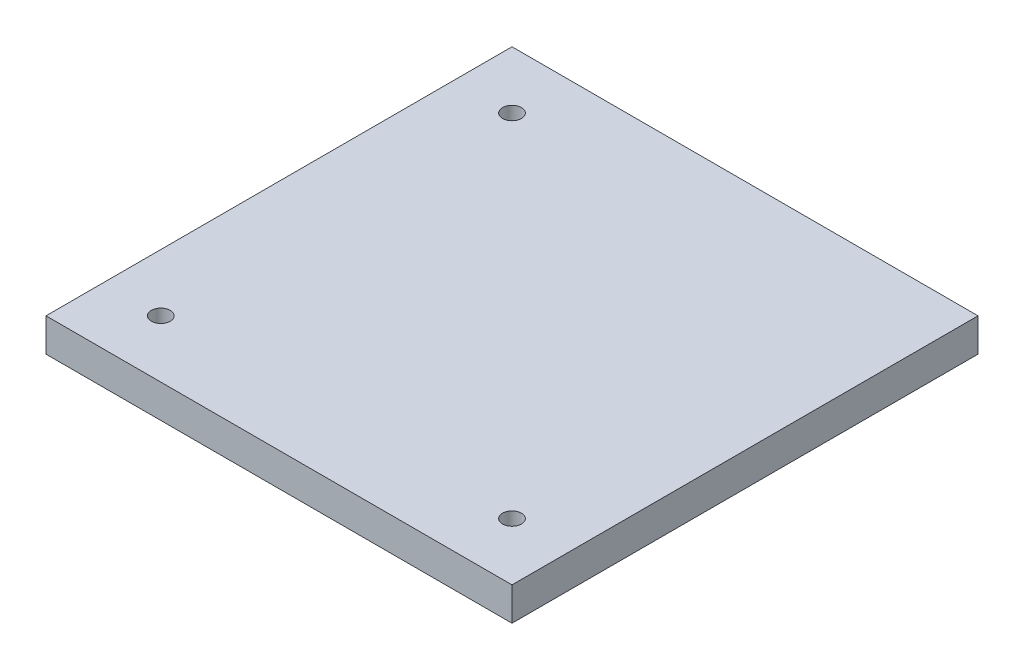
ISO-10303-21;
HEADER;
FILE_DESCRIPTION(('STEP AP214'),'2;1');
FILE_NAME('part.step','',(''),(''),'','','');
FILE_SCHEMA(('AUTOMOTIVE_DESIGN { 1 0 10303 214 1 1 1 1 }'));
ENDSEC;
DATA;
#1=APPLICATION_CONTEXT('core data for automotive mechanical design processes');
#2=APPLICATION_PROTOCOL_DEFINITION('international standard','automotive_design',2000,#1);
#3=PRODUCT_CONTEXT('',#1,'mechanical');
#4=PRODUCT('Part','Part','',(#3));
#5=PRODUCT_RELATED_PRODUCT_CATEGORY('part','',(#4));
#6=PRODUCT_DEFINITION_FORMATION('','',#4);
#7=PRODUCT_DEFINITION_CONTEXT('part definition',#1,'design');
#8=PRODUCT_DEFINITION('design','',#6,#7);
#9=PRODUCT_DEFINITION_SHAPE('','',#8);
#10=(LENGTH_UNIT() NAMED_UNIT(*) SI_UNIT(.MILLI.,.METRE.));
#11=(NAMED_UNIT(*) PLANE_ANGLE_UNIT() SI_UNIT($,.RADIAN.));
#12=(NAMED_UNIT(*) SI_UNIT($,.STERADIAN.) SOLID_ANGLE_UNIT());
#13=UNCERTAINTY_MEASURE_WITH_UNIT(LENGTH_MEASURE(1.E-05),#10,'distance_accuracy_value','');
#14=(GEOMETRIC_REPRESENTATION_CONTEXT(3) GLOBAL_UNCERTAINTY_ASSIGNED_CONTEXT((#13)) GLOBAL_UNIT_ASSIGNED_CONTEXT((#10,
#11,#12)) REPRESENTATION_CONTEXT('',''));
#15=CARTESIAN_POINT('',(0.,0.,0.));
#16=DIRECTION('',(0.,0.,1.));
#17=DIRECTION('',(1.,0.,0.));
#18=AXIS2_PLACEMENT_3D('',#15,#16,#17);
#19=CARTESIAN_POINT('',(0.,5.,0.));
#20=DIRECTION('',(1.,0.,0.));
#21=DIRECTION('',(0.,0.,-1.));
#22=AXIS2_PLACEMENT_3D('',#19,#20,#21);
#23=PLANE('',#22);
#24=DIRECTION('',(0.,0.,1.));
#25=VECTOR('',#24,1.);
#26=CARTESIAN_POINT('',(0.,0.,0.));
#27=LINE('',#26,#25);
#28=CARTESIAN_POINT('',(0.,0.,-70.104));
#29=VERTEX_POINT('',#28);
#30=CARTESIAN_POINT('',(0.,0.,0.));
#31=VERTEX_POINT('',#30);
#32=EDGE_CURVE('E99',#29,#31,#27,.T.);
#33=ORIENTED_EDGE('',*,*,#32,.T.);
#34=DIRECTION('',(0.,-1.,0.));
#35=VECTOR('',#34,1.);
#36=CARTESIAN_POINT('',(0.,5.,0.));
#37=LINE('',#36,#35);
#38=CARTESIAN_POINT('',(0.,5.,0.));
#39=VERTEX_POINT('',#38);
#40=EDGE_CURVE('E11',#39,#31,#37,.T.);
#41=ORIENTED_EDGE('',*,*,#40,.F.);
#42=DIRECTION('',(0.,0.,1.));
#43=VECTOR('',#42,1.);
#44=CARTESIAN_POINT('',(0.,5.,0.));
#45=LINE('',#44,#43);
#46=CARTESIAN_POINT('',(0.,5.,-70.104));
#47=VERTEX_POINT('',#46);
#48=EDGE_CURVE('E86',#47,#39,#45,.T.);
#49=ORIENTED_EDGE('',*,*,#48,.F.);
#50=DIRECTION('',(0.,-1.,0.));
#51=VECTOR('',#50,1.);
#52=CARTESIAN_POINT('',(0.,5.,-70.104));
#53=LINE('',#52,#51);
#54=EDGE_CURVE('E95',#47,#29,#53,.T.);
#55=ORIENTED_EDGE('',*,*,#54,.T.);
#56=EDGE_LOOP('',(#33,#41,#49,#55));
#57=FACE_BOUND('',#56,.T.);
#58=ADVANCED_FACE('F33',(#57),#23,.F.);
#59=CARTESIAN_POINT('',(0.,5.,0.));
#60=DIRECTION('',(0.,0.,-1.));
#61=DIRECTION('',(-1.,0.,0.));
#62=AXIS2_PLACEMENT_3D('',#59,#60,#61);
#63=PLANE('',#62);
#64=DIRECTION('',(1.,0.,0.));
#65=VECTOR('',#64,1.);
#66=CARTESIAN_POINT('',(0.,0.,0.));
#67=LINE('',#66,#65);
#68=CARTESIAN_POINT('',(70.104,0.,0.));
#69=VERTEX_POINT('',#68);
#70=EDGE_CURVE('E90',#31,#69,#67,.T.);
#71=ORIENTED_EDGE('',*,*,#70,.T.);
#72=DIRECTION('',(0.,-1.,0.));
#73=VECTOR('',#72,1.);
#74=CARTESIAN_POINT('',(70.104,5.,0.));
#75=LINE('',#74,#73);
#76=CARTESIAN_POINT('',(70.104,5.,0.));
#77=VERTEX_POINT('',#76);
#78=EDGE_CURVE('E42',#77,#69,#75,.T.);
#79=ORIENTED_EDGE('',*,*,#78,.F.);
#80=DIRECTION('',(1.,0.,0.));
#81=VECTOR('',#80,1.);
#82=CARTESIAN_POINT('',(0.,5.,0.));
#83=LINE('',#82,#81);
#84=EDGE_CURVE('E81',#39,#77,#83,.T.);
#85=ORIENTED_EDGE('',*,*,#84,.F.);
#86=ORIENTED_EDGE('',*,*,#40,.T.);
#87=EDGE_LOOP('',(#71,#79,#85,#86));
#88=FACE_BOUND('',#87,.T.);
#89=ADVANCED_FACE('F89',(#88),#63,.F.);
#90=CARTESIAN_POINT('',(70.104,5.,0.));
#91=DIRECTION('',(-1.,0.,0.));
#92=DIRECTION('',(0.,0.,1.));
#93=AXIS2_PLACEMENT_3D('',#90,#91,#92);
#94=PLANE('',#93);
#95=DIRECTION('',(0.,0.,-1.));
#96=VECTOR('',#95,1.);
#97=CARTESIAN_POINT('',(70.104,0.,0.));
#98=LINE('',#97,#96);
#99=CARTESIAN_POINT('',(70.104,0.,-70.104));
#100=VERTEX_POINT('',#99);
#101=EDGE_CURVE('E68',#69,#100,#98,.T.);
#102=ORIENTED_EDGE('',*,*,#101,.T.);
#103=DIRECTION('',(0.,-1.,0.));
#104=VECTOR('',#103,1.);
#105=CARTESIAN_POINT('',(70.104,5.,-70.104));
#106=LINE('',#105,#104);
#107=CARTESIAN_POINT('',(70.104,5.,-70.104));
#108=VERTEX_POINT('',#107);
#109=EDGE_CURVE('E91',#108,#100,#106,.T.);
#110=ORIENTED_EDGE('',*,*,#109,.F.);
#111=DIRECTION('',(0.,0.,-1.));
#112=VECTOR('',#111,1.);
#113=CARTESIAN_POINT('',(70.104,5.,0.));
#114=LINE('',#113,#112);
#115=EDGE_CURVE('E84',#77,#108,#114,.T.);
#116=ORIENTED_EDGE('',*,*,#115,.F.);
#117=ORIENTED_EDGE('',*,*,#78,.T.);
#118=EDGE_LOOP('',(#102,#110,#116,#117));
#119=FACE_BOUND('',#118,.T.);
#120=ADVANCED_FACE('F93',(#119),#94,.F.);
#121=CARTESIAN_POINT('',(0.,5.,-70.104));
#122=DIRECTION('',(0.,0.,1.));
#123=DIRECTION('',(1.,0.,0.));
#124=AXIS2_PLACEMENT_3D('',#121,#122,#123);
#125=PLANE('',#124);
#126=DIRECTION('',(-1.,0.,0.));
#127=VECTOR('',#126,1.);
#128=CARTESIAN_POINT('',(0.,0.,-70.104));
#129=LINE('',#128,#127);
#130=EDGE_CURVE('E74',#100,#29,#129,.T.);
#131=ORIENTED_EDGE('',*,*,#130,.T.);
#132=ORIENTED_EDGE('',*,*,#54,.F.);
#133=DIRECTION('',(-1.,0.,0.));
#134=VECTOR('',#133,1.);
#135=CARTESIAN_POINT('',(0.,5.,-70.104));
#136=LINE('',#135,#134);
#137=EDGE_CURVE('E51',#108,#47,#136,.T.);
#138=ORIENTED_EDGE('',*,*,#137,.F.);
#139=ORIENTED_EDGE('',*,*,#109,.T.);
#140=EDGE_LOOP('',(#131,#132,#138,#139));
#141=FACE_BOUND('',#140,.T.);
#142=ADVANCED_FACE('F132',(#141),#125,.F.);
#143=CARTESIAN_POINT('',(0.,5.,0.));
#144=DIRECTION('',(0.,-1.,0.));
#145=DIRECTION('',(0.,0.,-1.));
#146=AXIS2_PLACEMENT_3D('',#143,#144,#145);
#147=PLANE('',#146);
#148=CARTESIAN_POINT('',(61.468,5.,-8.636));
#149=DIRECTION('',(0.,1.,0.));
#150=DIRECTION('',(0.,0.,-1.));
#151=AXIS2_PLACEMENT_3D('',#148,#149,#150);
#152=CIRCLE('',#151,1.4224);
#153=CARTESIAN_POINT('',(61.468,5.,-10.0584));
#154=VERTEX_POINT('',#153);
#155=EDGE_CURVE('E122',#154,#154,#152,.T.);
#156=ORIENTED_EDGE('',*,*,#155,.F.);
#157=EDGE_LOOP('',(#156));
#158=FACE_BOUND('',#157,.T.);
#159=CARTESIAN_POINT('',(8.636,5.,-61.468));
#160=DIRECTION('',(0.,1.,0.));
#161=DIRECTION('',(0.,0.,-1.));
#162=AXIS2_PLACEMENT_3D('',#159,#160,#161);
#163=CIRCLE('',#162,1.4224);
#164=CARTESIAN_POINT('',(8.636,5.,-62.8904));
#165=VERTEX_POINT('',#164);
#166=EDGE_CURVE('E112',#165,#165,#163,.T.);
#167=ORIENTED_EDGE('',*,*,#166,.F.);
#168=EDGE_LOOP('',(#167));
#169=FACE_BOUND('',#168,.T.);
#170=CARTESIAN_POINT('',(8.636,5.,-8.636));
#171=DIRECTION('',(0.,1.,0.));
#172=DIRECTION('',(0.,0.,1.));
#173=AXIS2_PLACEMENT_3D('',#170,#171,#172);
#174=CIRCLE('',#173,1.4224);
#175=CARTESIAN_POINT('',(8.636,5.,-7.2136));
#176=VERTEX_POINT('',#175);
#177=EDGE_CURVE('E109',#176,#176,#174,.T.);
#178=ORIENTED_EDGE('',*,*,#177,.F.);
#179=EDGE_LOOP('',(#178));
#180=FACE_BOUND('',#179,.T.);
#181=ORIENTED_EDGE('',*,*,#48,.T.);
#182=ORIENTED_EDGE('',*,*,#84,.T.);
#183=ORIENTED_EDGE('',*,*,#115,.T.);
#184=ORIENTED_EDGE('',*,*,#137,.T.);
#185=EDGE_LOOP('',(#181,#182,#183,#184));
#186=FACE_BOUND('',#185,.T.);
#187=ADVANCED_FACE('F82',(#158,#169,#180,#186),#147,.F.);
#188=CARTESIAN_POINT('',(0.,0.,0.));
#189=DIRECTION('',(0.,-1.,0.));
#190=DIRECTION('',(0.,0.,-1.));
#191=AXIS2_PLACEMENT_3D('',#188,#189,#190);
#192=PLANE('',#191);
#193=CARTESIAN_POINT('',(61.468,0.,-8.636));
#194=DIRECTION('',(0.,-1.,0.));
#195=DIRECTION('',(0.,0.,-1.));
#196=AXIS2_PLACEMENT_3D('',#193,#194,#195);
#197=CIRCLE('',#196,1.4224);
#198=CARTESIAN_POINT('',(61.468,0.,-10.0584));
#199=VERTEX_POINT('',#198);
#200=EDGE_CURVE('E36',#199,#199,#197,.T.);
#201=ORIENTED_EDGE('',*,*,#200,.F.);
#202=EDGE_LOOP('',(#201));
#203=FACE_BOUND('',#202,.T.);
#204=CARTESIAN_POINT('',(8.636,0.,-61.468));
#205=DIRECTION('',(0.,-1.,0.));
#206=DIRECTION('',(0.,0.,-1.));
#207=AXIS2_PLACEMENT_3D('',#204,#205,#206);
#208=CIRCLE('',#207,1.4224);
#209=CARTESIAN_POINT('',(8.636,0.,-62.8904));
#210=VERTEX_POINT('',#209);
#211=EDGE_CURVE('E110',#210,#210,#208,.T.);
#212=ORIENTED_EDGE('',*,*,#211,.F.);
#213=EDGE_LOOP('',(#212));
#214=FACE_BOUND('',#213,.T.);
#215=CARTESIAN_POINT('',(8.636,0.,-8.636));
#216=DIRECTION('',(0.,-1.,0.));
#217=DIRECTION('',(0.,0.,-1.));
#218=AXIS2_PLACEMENT_3D('',#215,#216,#217);
#219=CIRCLE('',#218,1.4224);
#220=CARTESIAN_POINT('',(8.636,0.,-10.0584));
#221=VERTEX_POINT('',#220);
#222=EDGE_CURVE('E102',#221,#221,#219,.T.);
#223=ORIENTED_EDGE('',*,*,#222,.F.);
#224=EDGE_LOOP('',(#223));
#225=FACE_BOUND('',#224,.T.);
#226=ORIENTED_EDGE('',*,*,#32,.F.);
#227=ORIENTED_EDGE('',*,*,#130,.F.);
#228=ORIENTED_EDGE('',*,*,#101,.F.);
#229=ORIENTED_EDGE('',*,*,#70,.F.);
#230=EDGE_LOOP('',(#226,#227,#228,#229));
#231=FACE_BOUND('',#230,.T.);
#232=ADVANCED_FACE('F131',(#203,#214,#225,#231),#192,.T.);
#233=CARTESIAN_POINT('',(8.636,-1.35,-8.636));
#234=DIRECTION('',(0.,1.,0.));
#235=DIRECTION('',(0.,0.,1.));
#236=AXIS2_PLACEMENT_3D('',#233,#234,#235);
#237=CYLINDRICAL_SURFACE('',#236,1.4224);
#238=ORIENTED_EDGE('',*,*,#222,.T.);
#239=EDGE_LOOP('',(#238));
#240=FACE_BOUND('',#239,.T.);
#241=ORIENTED_EDGE('',*,*,#177,.T.);
#242=EDGE_LOOP('',(#241));
#243=FACE_BOUND('',#242,.T.);
#244=ADVANCED_FACE('F137',(#240,#243),#237,.F.);
#245=CARTESIAN_POINT('',(8.636,-1.35,-61.468));
#246=DIRECTION('',(0.,1.,0.));
#247=DIRECTION('',(0.,0.,1.));
#248=AXIS2_PLACEMENT_3D('',#245,#246,#247);
#249=CYLINDRICAL_SURFACE('',#248,1.4224);
#250=ORIENTED_EDGE('',*,*,#211,.T.);
#251=EDGE_LOOP('',(#250));
#252=FACE_BOUND('',#251,.T.);
#253=ORIENTED_EDGE('',*,*,#166,.T.);
#254=EDGE_LOOP('',(#253));
#255=FACE_BOUND('',#254,.T.);
#256=ADVANCED_FACE('F139',(#252,#255),#249,.F.);
#257=CARTESIAN_POINT('',(61.468,-1.35,-8.636));
#258=DIRECTION('',(0.,1.,0.));
#259=DIRECTION('',(0.,0.,1.));
#260=AXIS2_PLACEMENT_3D('',#257,#258,#259);
#261=CYLINDRICAL_SURFACE('',#260,1.4224);
#262=ORIENTED_EDGE('',*,*,#200,.T.);
#263=EDGE_LOOP('',(#262));
#264=FACE_BOUND('',#263,.T.);
#265=ORIENTED_EDGE('',*,*,#155,.T.);
#266=EDGE_LOOP('',(#265));
#267=FACE_BOUND('',#266,.T.);
#268=ADVANCED_FACE('F127',(#264,#267),#261,.F.);
#269=CLOSED_SHELL('',(#58,#89,#120,#142,#187,#232,#244,#256,#268));
#270=MANIFOLD_SOLID_BREP('B2',#269);
#271=ADVANCED_BREP_SHAPE_REPRESENTATION('',(#18,#270),#14);
#272=SHAPE_DEFINITION_REPRESENTATION(#9,#271);
ENDSEC;
END-ISO-10303-21;
